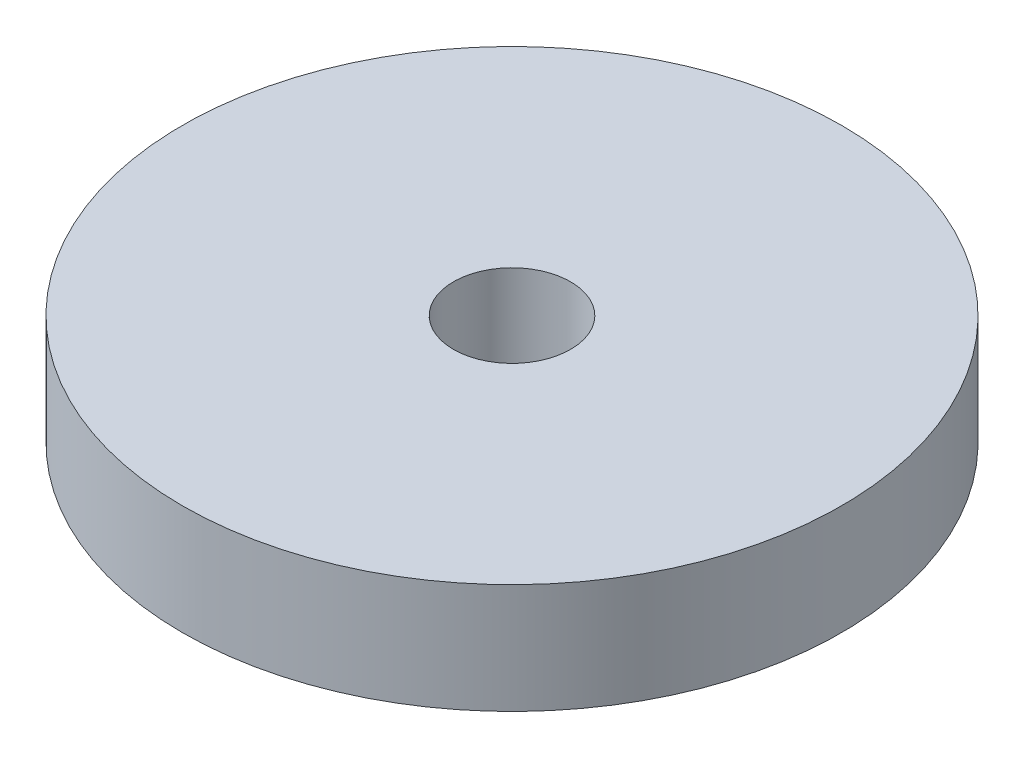
ISO-10303-21;
HEADER;
FILE_DESCRIPTION(('STEP AP214'),'2;1');
FILE_NAME('part.step','',(''),(''),'','','');
FILE_SCHEMA(('AUTOMOTIVE_DESIGN { 1 0 10303 214 1 1 1 1 }'));
ENDSEC;
DATA;
#1=APPLICATION_CONTEXT('core data for automotive mechanical design processes');
#2=APPLICATION_PROTOCOL_DEFINITION('international standard','automotive_design',2000,#1);
#3=PRODUCT_CONTEXT('',#1,'mechanical');
#4=PRODUCT('Part','Part','',(#3));
#5=PRODUCT_RELATED_PRODUCT_CATEGORY('part','',(#4));
#6=PRODUCT_DEFINITION_FORMATION('','',#4);
#7=PRODUCT_DEFINITION_CONTEXT('part definition',#1,'design');
#8=PRODUCT_DEFINITION('design','',#6,#7);
#9=PRODUCT_DEFINITION_SHAPE('','',#8);
#10=(LENGTH_UNIT() NAMED_UNIT(*) SI_UNIT(.MILLI.,.METRE.));
#11=(NAMED_UNIT(*) PLANE_ANGLE_UNIT() SI_UNIT($,.RADIAN.));
#12=(NAMED_UNIT(*) SI_UNIT($,.STERADIAN.) SOLID_ANGLE_UNIT());
#13=UNCERTAINTY_MEASURE_WITH_UNIT(LENGTH_MEASURE(1.E-05),#10,'distance_accuracy_value','');
#14=(GEOMETRIC_REPRESENTATION_CONTEXT(3) GLOBAL_UNCERTAINTY_ASSIGNED_CONTEXT((#13)) GLOBAL_UNIT_ASSIGNED_CONTEXT((#10,
#11,#12)) REPRESENTATION_CONTEXT('',''));
#15=CARTESIAN_POINT('',(0.,0.,0.));
#16=DIRECTION('',(0.,0.,1.));
#17=DIRECTION('',(1.,0.,0.));
#18=AXIS2_PLACEMENT_3D('',#15,#16,#17);
#19=CARTESIAN_POINT('',(0.,3.,0.));
#20=DIRECTION('',(0.,1.,0.));
#21=DIRECTION('',(0.,0.,1.));
#22=AXIS2_PLACEMENT_3D('',#19,#20,#21);
#23=PLANE('',#22);
#24=CARTESIAN_POINT('',(0.,3.,0.));
#25=DIRECTION('',(0.,1.,0.));
#26=DIRECTION('',(0.,0.,1.));
#27=AXIS2_PLACEMENT_3D('',#24,#25,#26);
#28=CIRCLE('',#27,9.);
#29=CARTESIAN_POINT('',(0.,3.,9.));
#30=VERTEX_POINT('',#29);
#31=EDGE_CURVE('E10',#30,#30,#28,.T.);
#32=ORIENTED_EDGE('',*,*,#31,.T.);
#33=EDGE_LOOP('',(#32));
#34=FACE_BOUND('',#33,.T.);
#35=CARTESIAN_POINT('',(0.,3.,0.));
#36=DIRECTION('',(0.,1.,0.));
#37=DIRECTION('',(0.,0.,1.));
#38=AXIS2_PLACEMENT_3D('',#35,#36,#37);
#39=CIRCLE('',#38,1.6);
#40=CARTESIAN_POINT('',(0.,3.,1.6));
#41=VERTEX_POINT('',#40);
#42=EDGE_CURVE('E56',#41,#41,#39,.T.);
#43=ORIENTED_EDGE('',*,*,#42,.F.);
#44=EDGE_LOOP('',(#43));
#45=FACE_BOUND('',#44,.T.);
#46=ADVANCED_FACE('F43',(#34,#45),#23,.T.);
#47=CARTESIAN_POINT('',(0.,0.,0.));
#48=DIRECTION('',(0.,1.,0.));
#49=DIRECTION('',(0.,0.,1.));
#50=AXIS2_PLACEMENT_3D('',#47,#48,#49);
#51=PLANE('',#50);
#52=CARTESIAN_POINT('',(0.,0.,0.));
#53=DIRECTION('',(0.,1.,0.));
#54=DIRECTION('',(0.,0.,1.));
#55=AXIS2_PLACEMENT_3D('',#52,#53,#54);
#56=CIRCLE('',#55,9.);
#57=CARTESIAN_POINT('',(0.,0.,9.));
#58=VERTEX_POINT('',#57);
#59=EDGE_CURVE('E47',#58,#58,#56,.T.);
#60=ORIENTED_EDGE('',*,*,#59,.F.);
#61=EDGE_LOOP('',(#60));
#62=FACE_BOUND('',#61,.T.);
#63=CARTESIAN_POINT('',(0.,0.,0.));
#64=DIRECTION('',(0.,1.,0.));
#65=DIRECTION('',(0.,0.,1.));
#66=AXIS2_PLACEMENT_3D('',#63,#64,#65);
#67=CIRCLE('',#66,1.6);
#68=CARTESIAN_POINT('',(0.,0.,1.6));
#69=VERTEX_POINT('',#68);
#70=EDGE_CURVE('E58',#69,#69,#67,.T.);
#71=ORIENTED_EDGE('',*,*,#70,.T.);
#72=EDGE_LOOP('',(#71));
#73=FACE_BOUND('',#72,.T.);
#74=ADVANCED_FACE('F70',(#62,#73),#51,.F.);
#75=CARTESIAN_POINT('',(0.,3.,0.));
#76=DIRECTION('',(0.,-1.,0.));
#77=DIRECTION('',(0.,0.,-1.));
#78=AXIS2_PLACEMENT_3D('',#75,#76,#77);
#79=CYLINDRICAL_SURFACE('',#78,9.);
#80=ORIENTED_EDGE('',*,*,#31,.F.);
#81=EDGE_LOOP('',(#80));
#82=FACE_BOUND('',#81,.T.);
#83=ORIENTED_EDGE('',*,*,#59,.T.);
#84=EDGE_LOOP('',(#83));
#85=FACE_BOUND('',#84,.T.);
#86=ADVANCED_FACE('F45',(#82,#85),#79,.T.);
#87=CARTESIAN_POINT('',(0.,3.,0.));
#88=DIRECTION('',(0.,-1.,0.));
#89=DIRECTION('',(0.,0.,-1.));
#90=AXIS2_PLACEMENT_3D('',#87,#88,#89);
#91=CYLINDRICAL_SURFACE('',#90,1.6);
#92=ORIENTED_EDGE('',*,*,#42,.T.);
#93=EDGE_LOOP('',(#92));
#94=FACE_BOUND('',#93,.T.);
#95=ORIENTED_EDGE('',*,*,#70,.F.);
#96=EDGE_LOOP('',(#95));
#97=FACE_BOUND('',#96,.T.);
#98=ADVANCED_FACE('F66',(#94,#97),#91,.F.);
#99=CLOSED_SHELL('',(#46,#74,#86,#98));
#100=MANIFOLD_SOLID_BREP('B2',#99);
#101=ADVANCED_BREP_SHAPE_REPRESENTATION('',(#18,#100),#14);
#102=SHAPE_DEFINITION_REPRESENTATION(#9,#101);
ENDSEC;
END-ISO-10303-21;
